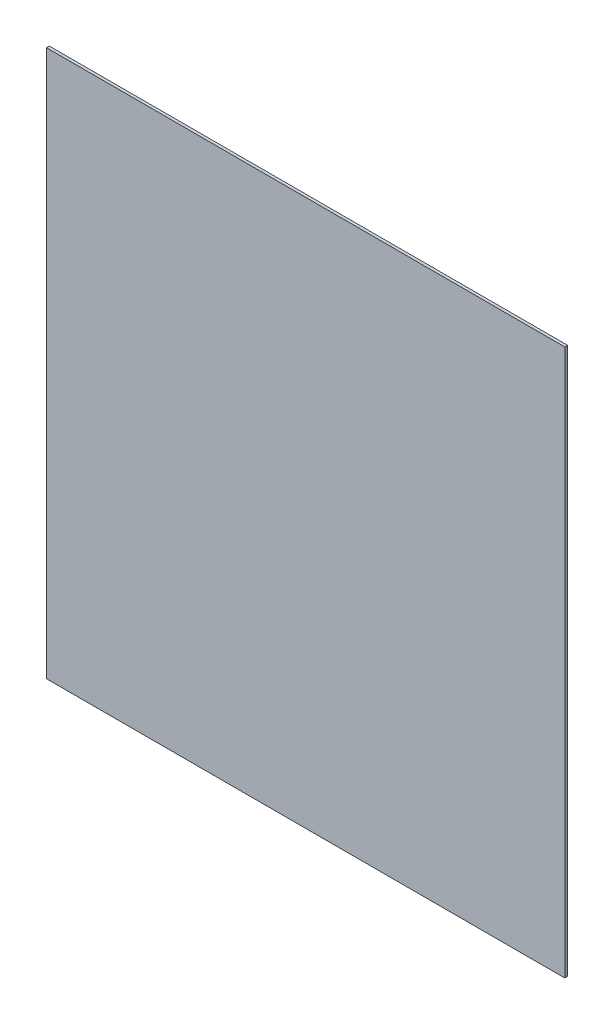
ISO-10303-21;
HEADER;
FILE_DESCRIPTION(('STEP AP214'),'2;1');
FILE_NAME('part.step','',(''),(''),'','','');
FILE_SCHEMA(('AUTOMOTIVE_DESIGN { 1 0 10303 214 1 1 1 1 }'));
ENDSEC;
DATA;
#1=APPLICATION_CONTEXT('core data for automotive mechanical design processes');
#2=APPLICATION_PROTOCOL_DEFINITION('international standard','automotive_design',2000,#1);
#3=PRODUCT_CONTEXT('',#1,'mechanical');
#4=PRODUCT('Part','Part','',(#3));
#5=PRODUCT_RELATED_PRODUCT_CATEGORY('part','',(#4));
#6=PRODUCT_DEFINITION_FORMATION('','',#4);
#7=PRODUCT_DEFINITION_CONTEXT('part definition',#1,'design');
#8=PRODUCT_DEFINITION('design','',#6,#7);
#9=PRODUCT_DEFINITION_SHAPE('','',#8);
#10=(LENGTH_UNIT() NAMED_UNIT(*) SI_UNIT(.MILLI.,.METRE.));
#11=(NAMED_UNIT(*) PLANE_ANGLE_UNIT() SI_UNIT($,.RADIAN.));
#12=(NAMED_UNIT(*) SI_UNIT($,.STERADIAN.) SOLID_ANGLE_UNIT());
#13=UNCERTAINTY_MEASURE_WITH_UNIT(LENGTH_MEASURE(1.E-05),#10,'distance_accuracy_value','');
#14=(GEOMETRIC_REPRESENTATION_CONTEXT(3) GLOBAL_UNCERTAINTY_ASSIGNED_CONTEXT((#13)) GLOBAL_UNIT_ASSIGNED_CONTEXT((#10,
#11,#12)) REPRESENTATION_CONTEXT('',''));
#15=CARTESIAN_POINT('',(0.,0.,0.));
#16=DIRECTION('',(0.,0.,1.));
#17=DIRECTION('',(1.,0.,0.));
#18=AXIS2_PLACEMENT_3D('',#15,#16,#17);
#19=CARTESIAN_POINT('',(184.,194.,0.));
#20=DIRECTION('',(0.,0.,1.));
#21=DIRECTION('',(1.,0.,0.));
#22=AXIS2_PLACEMENT_3D('',#19,#20,#21);
#23=PLANE('',#22);
#24=DIRECTION('',(0.,1.,0.));
#25=VECTOR('',#24,1.);
#26=CARTESIAN_POINT('',(0.,388.,0.));
#27=LINE('',#26,#25);
#28=CARTESIAN_POINT('',(0.,388.,0.));
#29=VERTEX_POINT('',#28);
#30=CARTESIAN_POINT('',(0.,0.,0.));
#31=VERTEX_POINT('',#30);
#32=EDGE_CURVE('E78',#29,#31,#27,.F.);
#33=ORIENTED_EDGE('',*,*,#32,.F.);
#34=DIRECTION('',(1.,0.,0.));
#35=VECTOR('',#34,1.);
#36=CARTESIAN_POINT('',(368.,388.,0.));
#37=LINE('',#36,#35);
#38=CARTESIAN_POINT('',(368.,388.,0.));
#39=VERTEX_POINT('',#38);
#40=EDGE_CURVE('E54',#39,#29,#37,.F.);
#41=ORIENTED_EDGE('',*,*,#40,.F.);
#42=DIRECTION('',(0.,1.,0.));
#43=VECTOR('',#42,1.);
#44=CARTESIAN_POINT('',(368.,0.,0.));
#45=LINE('',#44,#43);
#46=CARTESIAN_POINT('',(368.,0.,0.));
#47=VERTEX_POINT('',#46);
#48=EDGE_CURVE('E56',#47,#39,#45,.T.);
#49=ORIENTED_EDGE('',*,*,#48,.F.);
#50=DIRECTION('',(1.,0.,0.));
#51=VECTOR('',#50,1.);
#52=CARTESIAN_POINT('',(0.,0.,0.));
#53=LINE('',#52,#51);
#54=EDGE_CURVE('E19',#31,#47,#53,.T.);
#55=ORIENTED_EDGE('',*,*,#54,.F.);
#56=EDGE_LOOP('',(#33,#41,#49,#55));
#57=FACE_BOUND('',#56,.T.);
#58=ADVANCED_FACE('F16',(#57),#23,.F.);
#59=CARTESIAN_POINT('',(0.,0.,0.));
#60=DIRECTION('',(0.,-1.,0.));
#61=DIRECTION('',(0.,0.,-1.));
#62=AXIS2_PLACEMENT_3D('',#59,#60,#61);
#63=PLANE('',#62);
#64=DIRECTION('',(1.,0.,0.));
#65=VECTOR('',#64,1.);
#66=CARTESIAN_POINT('',(184.,0.,2.));
#67=LINE('',#66,#65);
#68=CARTESIAN_POINT('',(0.,0.,2.));
#69=VERTEX_POINT('',#68);
#70=CARTESIAN_POINT('',(368.,0.,2.));
#71=VERTEX_POINT('',#70);
#72=EDGE_CURVE('E82',#69,#71,#67,.T.);
#73=ORIENTED_EDGE('',*,*,#72,.F.);
#74=DIRECTION('',(0.,0.,1.));
#75=VECTOR('',#74,1.);
#76=CARTESIAN_POINT('',(0.,0.,0.));
#77=LINE('',#76,#75);
#78=EDGE_CURVE('E67',#31,#69,#77,.T.);
#79=ORIENTED_EDGE('',*,*,#78,.F.);
#80=ORIENTED_EDGE('',*,*,#54,.T.);
#81=DIRECTION('',(0.,0.,-1.));
#82=VECTOR('',#81,1.);
#83=CARTESIAN_POINT('',(368.,0.,0.));
#84=LINE('',#83,#82);
#85=EDGE_CURVE('E62',#71,#47,#84,.T.);
#86=ORIENTED_EDGE('',*,*,#85,.F.);
#87=EDGE_LOOP('',(#73,#79,#80,#86));
#88=FACE_BOUND('',#87,.T.);
#89=ADVANCED_FACE('F64',(#88),#63,.T.);
#90=CARTESIAN_POINT('',(368.,0.,0.));
#91=DIRECTION('',(1.,0.,0.));
#92=DIRECTION('',(0.,0.,-1.));
#93=AXIS2_PLACEMENT_3D('',#90,#91,#92);
#94=PLANE('',#93);
#95=DIRECTION('',(0.,1.,0.));
#96=VECTOR('',#95,1.);
#97=CARTESIAN_POINT('',(368.,194.,2.));
#98=LINE('',#97,#96);
#99=CARTESIAN_POINT('',(368.,388.,2.));
#100=VERTEX_POINT('',#99);
#101=EDGE_CURVE('E71',#71,#100,#98,.T.);
#102=ORIENTED_EDGE('',*,*,#101,.F.);
#103=ORIENTED_EDGE('',*,*,#85,.T.);
#104=ORIENTED_EDGE('',*,*,#48,.T.);
#105=DIRECTION('',(0.,0.,1.));
#106=VECTOR('',#105,1.);
#107=CARTESIAN_POINT('',(368.,388.,0.));
#108=LINE('',#107,#106);
#109=EDGE_CURVE('E74',#100,#39,#108,.F.);
#110=ORIENTED_EDGE('',*,*,#109,.F.);
#111=EDGE_LOOP('',(#102,#103,#104,#110));
#112=FACE_BOUND('',#111,.T.);
#113=ADVANCED_FACE('F69',(#112),#94,.T.);
#114=CARTESIAN_POINT('',(368.,388.,0.));
#115=DIRECTION('',(0.,1.,0.));
#116=DIRECTION('',(0.,0.,1.));
#117=AXIS2_PLACEMENT_3D('',#114,#115,#116);
#118=PLANE('',#117);
#119=DIRECTION('',(1.,0.,0.));
#120=VECTOR('',#119,1.);
#121=CARTESIAN_POINT('',(184.,388.,2.));
#122=LINE('',#121,#120);
#123=CARTESIAN_POINT('',(0.,388.,2.));
#124=VERTEX_POINT('',#123);
#125=EDGE_CURVE('E25',#100,#124,#122,.F.);
#126=ORIENTED_EDGE('',*,*,#125,.F.);
#127=ORIENTED_EDGE('',*,*,#109,.T.);
#128=ORIENTED_EDGE('',*,*,#40,.T.);
#129=DIRECTION('',(0.,0.,1.));
#130=VECTOR('',#129,1.);
#131=CARTESIAN_POINT('',(0.,388.,0.));
#132=LINE('',#131,#130);
#133=EDGE_CURVE('E34',#124,#29,#132,.F.);
#134=ORIENTED_EDGE('',*,*,#133,.F.);
#135=EDGE_LOOP('',(#126,#127,#128,#134));
#136=FACE_BOUND('',#135,.T.);
#137=ADVANCED_FACE('F88',(#136),#118,.T.);
#138=CARTESIAN_POINT('',(0.,388.,0.));
#139=DIRECTION('',(-1.,0.,0.));
#140=DIRECTION('',(0.,0.,1.));
#141=AXIS2_PLACEMENT_3D('',#138,#139,#140);
#142=PLANE('',#141);
#143=DIRECTION('',(0.,1.,0.));
#144=VECTOR('',#143,1.);
#145=CARTESIAN_POINT('',(0.,194.,2.));
#146=LINE('',#145,#144);
#147=EDGE_CURVE('E11',#124,#69,#146,.F.);
#148=ORIENTED_EDGE('',*,*,#147,.F.);
#149=ORIENTED_EDGE('',*,*,#133,.T.);
#150=ORIENTED_EDGE('',*,*,#32,.T.);
#151=ORIENTED_EDGE('',*,*,#78,.T.);
#152=EDGE_LOOP('',(#148,#149,#150,#151));
#153=FACE_BOUND('',#152,.T.);
#154=ADVANCED_FACE('F90',(#153),#142,.T.);
#155=CARTESIAN_POINT('',(184.,194.,2.));
#156=DIRECTION('',(0.,0.,1.));
#157=DIRECTION('',(1.,0.,0.));
#158=AXIS2_PLACEMENT_3D('',#155,#156,#157);
#159=PLANE('',#158);
#160=ORIENTED_EDGE('',*,*,#125,.T.);
#161=ORIENTED_EDGE('',*,*,#147,.T.);
#162=ORIENTED_EDGE('',*,*,#72,.T.);
#163=ORIENTED_EDGE('',*,*,#101,.T.);
#164=EDGE_LOOP('',(#160,#161,#162,#163));
#165=FACE_BOUND('',#164,.T.);
#166=ADVANCED_FACE('F87',(#165),#159,.T.);
#167=CLOSED_SHELL('',(#58,#89,#113,#137,#154,#166));
#168=MANIFOLD_SOLID_BREP('B1',#167);
#169=ADVANCED_BREP_SHAPE_REPRESENTATION('',(#18,#168),#14);
#170=SHAPE_DEFINITION_REPRESENTATION(#9,#169);
ENDSEC;
END-ISO-10303-21;
